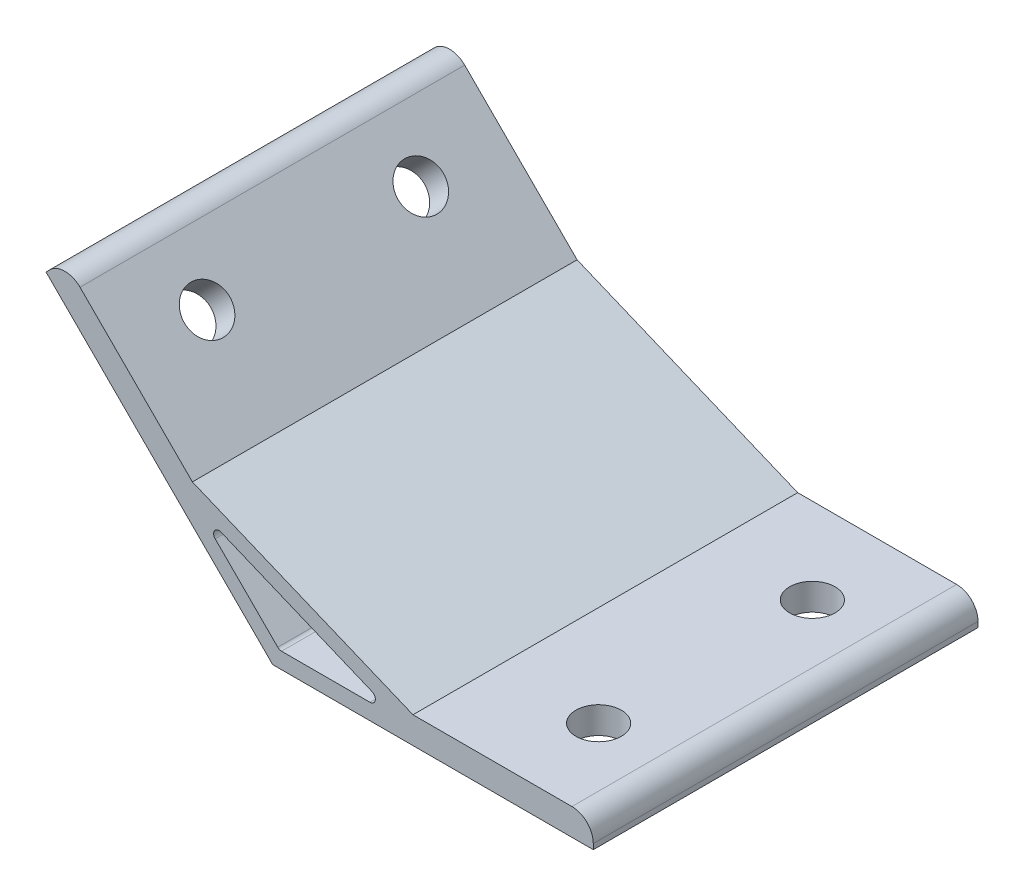
ISO-10303-21;
HEADER;
FILE_DESCRIPTION(('STEP AP214'),'2;1');
FILE_NAME('part.step','',(''),(''),'','','');
FILE_SCHEMA(('AUTOMOTIVE_DESIGN { 1 0 10303 214 1 1 1 1 }'));
ENDSEC;
DATA;
#1=APPLICATION_CONTEXT('core data for automotive mechanical design processes');
#2=APPLICATION_PROTOCOL_DEFINITION('international standard','automotive_design',2000,#1);
#3=PRODUCT_CONTEXT('',#1,'mechanical');
#4=PRODUCT('Part','Part','',(#3));
#5=PRODUCT_RELATED_PRODUCT_CATEGORY('part','',(#4));
#6=PRODUCT_DEFINITION_FORMATION('','',#4);
#7=PRODUCT_DEFINITION_CONTEXT('part definition',#1,'design');
#8=PRODUCT_DEFINITION('design','',#6,#7);
#9=PRODUCT_DEFINITION_SHAPE('','',#8);
#10=(LENGTH_UNIT() NAMED_UNIT(*) SI_UNIT(.MILLI.,.METRE.));
#11=(NAMED_UNIT(*) PLANE_ANGLE_UNIT() SI_UNIT($,.RADIAN.));
#12=(NAMED_UNIT(*) SI_UNIT($,.STERADIAN.) SOLID_ANGLE_UNIT());
#13=UNCERTAINTY_MEASURE_WITH_UNIT(LENGTH_MEASURE(1.E-05),#10,'distance_accuracy_value','');
#14=(GEOMETRIC_REPRESENTATION_CONTEXT(3) GLOBAL_UNCERTAINTY_ASSIGNED_CONTEXT((#13)) GLOBAL_UNIT_ASSIGNED_CONTEXT((#10,
#11,#12)) REPRESENTATION_CONTEXT('',''));
#15=CARTESIAN_POINT('',(0.,0.,0.));
#16=DIRECTION('',(0.,0.,1.));
#17=DIRECTION('',(1.,0.,0.));
#18=AXIS2_PLACEMENT_3D('',#15,#16,#17);
#19=CARTESIAN_POINT('',(0.,0.,36.));
#20=DIRECTION('',(0.,0.,1.));
#21=DIRECTION('',(1.,0.,0.));
#22=AXIS2_PLACEMENT_3D('',#19,#20,#21);
#23=PLANE('',#22);
#24=DIRECTION('',(0.,1.,0.));
#25=VECTOR('',#24,1.);
#26=CARTESIAN_POINT('',(60.,5.,36.));
#27=LINE('',#26,#25);
#28=CARTESIAN_POINT('',(60.,0.,36.));
#29=VERTEX_POINT('',#28);
#30=CARTESIAN_POINT('',(60.,1.,36.));
#31=VERTEX_POINT('',#30);
#32=EDGE_CURVE('E141',#29,#31,#27,.T.);
#33=ORIENTED_EDGE('',*,*,#32,.T.);
#34=CARTESIAN_POINT('',(56.,1.,36.));
#35=DIRECTION('',(0.,0.,1.));
#36=DIRECTION('',(1.,0.,0.));
#37=AXIS2_PLACEMENT_3D('',#34,#35,#36);
#38=CIRCLE('',#37,4.);
#39=CARTESIAN_POINT('',(56.,5.,36.));
#40=VERTEX_POINT('',#39);
#41=EDGE_CURVE('E183',#31,#40,#38,.T.);
#42=ORIENTED_EDGE('',*,*,#41,.T.);
#43=DIRECTION('',(-1.,0.,0.));
#44=VECTOR('',#43,1.);
#45=CARTESIAN_POINT('',(26.2535913516314,5.,36.));
#46=LINE('',#45,#44);
#47=CARTESIAN_POINT('',(26.2535913516314,5.,36.));
#48=VERTEX_POINT('',#47);
#49=EDGE_CURVE('E152',#40,#48,#46,.T.);
#50=ORIENTED_EDGE('',*,*,#49,.T.);
#51=DIRECTION('',(-0.923879532511286,0.382683432365091,0.));
#52=VECTOR('',#51,1.);
#53=CARTESIAN_POINT('',(-15.0285585693063,22.0996263811718,36.));
#54=LINE('',#53,#52);
#55=CARTESIAN_POINT('',(-15.0285585693063,22.0996263811718,36.));
#56=VERTEX_POINT('',#55);
#57=EDGE_CURVE('E243',#48,#56,#54,.T.);
#58=ORIENTED_EDGE('',*,*,#57,.T.);
#59=DIRECTION('',(-0.707106781186549,0.707106781186547,0.));
#60=VECTOR('',#59,1.);
#61=CARTESIAN_POINT('',(-38.8908729652601,45.9619407771256,36.));
#62=LINE('',#61,#60);
#63=CARTESIAN_POINT('',(-36.0624458405139,43.1335136523794,36.));
#64=VERTEX_POINT('',#63);
#65=EDGE_CURVE('E245',#56,#64,#62,.T.);
#66=ORIENTED_EDGE('',*,*,#65,.T.);
#67=CARTESIAN_POINT('',(-38.8908729652601,40.3050865276332,36.));
#68=DIRECTION('',(0.,0.,1.));
#69=DIRECTION('',(1.,0.,0.));
#70=AXIS2_PLACEMENT_3D('',#67,#68,#69);
#71=CIRCLE('',#70,4.);
#72=CARTESIAN_POINT('',(-41.7193000900063,43.1335136523794,36.));
#73=VERTEX_POINT('',#72);
#74=EDGE_CURVE('E181',#64,#73,#71,.T.);
#75=ORIENTED_EDGE('',*,*,#74,.T.);
#76=DIRECTION('',(-0.707106781186547,-0.707106781186548,0.));
#77=VECTOR('',#76,1.);
#78=CARTESIAN_POINT('',(-42.4264068711928,42.4264068711929,36.));
#79=LINE('',#78,#77);
#80=CARTESIAN_POINT('',(-42.4264068711928,42.4264068711929,36.));
#81=VERTEX_POINT('',#80);
#82=EDGE_CURVE('E248',#73,#81,#79,.T.);
#83=ORIENTED_EDGE('',*,*,#82,.T.);
#84=DIRECTION('',(0.707106781186546,-0.707106781186549,0.));
#85=VECTOR('',#84,1.);
#86=CARTESIAN_POINT('',(0.,0.,36.));
#87=LINE('',#86,#85);
#88=CARTESIAN_POINT('',(0.,0.,36.));
#89=VERTEX_POINT('',#88);
#90=EDGE_CURVE('E157',#81,#89,#87,.T.);
#91=ORIENTED_EDGE('',*,*,#90,.T.);
#92=DIRECTION('',(1.,0.,0.));
#93=VECTOR('',#92,1.);
#94=CARTESIAN_POINT('',(60.,0.,36.));
#95=LINE('',#94,#93);
#96=EDGE_CURVE('E153',#89,#29,#95,.T.);
#97=ORIENTED_EDGE('',*,*,#96,.T.);
#98=EDGE_LOOP('',(#33,#42,#50,#58,#66,#75,#83,#91,#97));
#99=FACE_BOUND('',#98,.T.);
#100=DIRECTION('',(1.,0.,0.));
#101=VECTOR('',#100,1.);
#102=CARTESIAN_POINT('',(23.2426406871193,3.,36.));
#103=LINE('',#102,#101);
#104=CARTESIAN_POINT('',(1.65685424949239,3.,36.));
#105=VERTEX_POINT('',#104);
#106=CARTESIAN_POINT('',(18.2153011949935,3.,36.));
#107=VERTEX_POINT('',#106);
#108=EDGE_CURVE('E228',#105,#107,#103,.T.);
#109=ORIENTED_EDGE('',*,*,#108,.F.);
#110=CARTESIAN_POINT('',(1.65685424949239,4.,36.));
#111=DIRECTION('',(0.,0.,1.));
#112=DIRECTION('',(1.,0.,0.));
#113=AXIS2_PLACEMENT_3D('',#110,#111,#112);
#114=CIRCLE('',#113,1.);
#115=CARTESIAN_POINT('',(0.949747468305838,3.29289321881345,36.));
#116=VERTEX_POINT('',#115);
#117=EDGE_CURVE('E210',#105,#116,#114,.F.);
#118=ORIENTED_EDGE('',*,*,#117,.T.);
#119=DIRECTION('',(0.707106781186546,-0.707106781186549,0.));
#120=VECTOR('',#119,1.);
#121=CARTESIAN_POINT('',(1.24264068711929,3.,36.));
#122=LINE('',#121,#120);
#123=CARTESIAN_POINT('',(-10.7588426527756,15.001483339895,36.));
#124=VERTEX_POINT('',#123);
#125=EDGE_CURVE('E225',#124,#116,#122,.T.);
#126=ORIENTED_EDGE('',*,*,#125,.F.);
#127=CARTESIAN_POINT('',(-10.0517358715891,15.7085901210815,36.));
#128=DIRECTION('',(0.,0.,1.));
#129=DIRECTION('',(1.,0.,0.));
#130=AXIS2_PLACEMENT_3D('',#127,#128,#129);
#131=CIRCLE('',#130,1.);
#132=CARTESIAN_POINT('',(-9.66905243922398,16.6324696535928,36.));
#133=VERTEX_POINT('',#132);
#134=EDGE_CURVE('E206',#124,#133,#131,.F.);
#135=ORIENTED_EDGE('',*,*,#134,.T.);
#136=DIRECTION('',(-0.923879532511286,0.382683432365091,0.));
#137=VECTOR('',#136,1.);
#138=CARTESIAN_POINT('',(-14.3137084989847,18.5563491861041,36.));
#139=LINE('',#138,#137);
#140=CARTESIAN_POINT('',(18.5979846273586,4.92387953251128,36.));
#141=VERTEX_POINT('',#140);
#142=EDGE_CURVE('E230',#141,#133,#139,.T.);
#143=ORIENTED_EDGE('',*,*,#142,.F.);
#144=CARTESIAN_POINT('',(18.2153011949935,4.,36.));
#145=DIRECTION('',(0.,0.,1.));
#146=DIRECTION('',(1.,0.,0.));
#147=AXIS2_PLACEMENT_3D('',#144,#145,#146);
#148=CIRCLE('',#147,1.);
#149=EDGE_CURVE('E11',#141,#107,#148,.F.);
#150=ORIENTED_EDGE('',*,*,#149,.T.);
#151=EDGE_LOOP('',(#109,#118,#126,#135,#143,#150));
#152=FACE_BOUND('',#151,.T.);
#153=ADVANCED_FACE('F34',(#99,#152),#23,.T.);
#154=CARTESIAN_POINT('',(0.,0.,-36.));
#155=DIRECTION('',(0.,0.,1.));
#156=DIRECTION('',(1.,0.,0.));
#157=AXIS2_PLACEMENT_3D('',#154,#155,#156);
#158=PLANE('',#157);
#159=DIRECTION('',(-1.,0.,0.));
#160=VECTOR('',#159,1.);
#161=CARTESIAN_POINT('',(26.2535913516314,5.,-36.));
#162=LINE('',#161,#160);
#163=CARTESIAN_POINT('',(56.,5.,-36.));
#164=VERTEX_POINT('',#163);
#165=CARTESIAN_POINT('',(26.2535913516314,5.,-36.));
#166=VERTEX_POINT('',#165);
#167=EDGE_CURVE('E255',#164,#166,#162,.T.);
#168=ORIENTED_EDGE('',*,*,#167,.F.);
#169=CARTESIAN_POINT('',(56.,1.,-36.));
#170=DIRECTION('',(0.,0.,1.));
#171=DIRECTION('',(1.,0.,0.));
#172=AXIS2_PLACEMENT_3D('',#169,#170,#171);
#173=CIRCLE('',#172,4.);
#174=CARTESIAN_POINT('',(60.,1.,-36.));
#175=VERTEX_POINT('',#174);
#176=EDGE_CURVE('E178',#164,#175,#173,.F.);
#177=ORIENTED_EDGE('',*,*,#176,.T.);
#178=DIRECTION('',(0.,1.,0.));
#179=VECTOR('',#178,1.);
#180=CARTESIAN_POINT('',(60.,5.,-36.));
#181=LINE('',#180,#179);
#182=CARTESIAN_POINT('',(60.,0.,-36.));
#183=VERTEX_POINT('',#182);
#184=EDGE_CURVE('E253',#183,#175,#181,.T.);
#185=ORIENTED_EDGE('',*,*,#184,.F.);
#186=DIRECTION('',(1.,0.,0.));
#187=VECTOR('',#186,1.);
#188=CARTESIAN_POINT('',(60.,0.,-36.));
#189=LINE('',#188,#187);
#190=CARTESIAN_POINT('',(0.,0.,-36.));
#191=VERTEX_POINT('',#190);
#192=EDGE_CURVE('E165',#191,#183,#189,.T.);
#193=ORIENTED_EDGE('',*,*,#192,.F.);
#194=DIRECTION('',(0.707106781186546,-0.707106781186549,0.));
#195=VECTOR('',#194,1.);
#196=CARTESIAN_POINT('',(0.,0.,-36.));
#197=LINE('',#196,#195);
#198=CARTESIAN_POINT('',(-42.4264068711928,42.4264068711929,-36.));
#199=VERTEX_POINT('',#198);
#200=EDGE_CURVE('E161',#199,#191,#197,.T.);
#201=ORIENTED_EDGE('',*,*,#200,.F.);
#202=DIRECTION('',(-0.707106781186547,-0.707106781186548,0.));
#203=VECTOR('',#202,1.);
#204=CARTESIAN_POINT('',(-42.4264068711928,42.4264068711929,-36.));
#205=LINE('',#204,#203);
#206=CARTESIAN_POINT('',(-41.7193000900063,43.1335136523794,-36.));
#207=VERTEX_POINT('',#206);
#208=EDGE_CURVE('E262',#207,#199,#205,.T.);
#209=ORIENTED_EDGE('',*,*,#208,.F.);
#210=CARTESIAN_POINT('',(-38.8908729652601,40.3050865276332,-36.));
#211=DIRECTION('',(0.,0.,1.));
#212=DIRECTION('',(1.,0.,0.));
#213=AXIS2_PLACEMENT_3D('',#210,#211,#212);
#214=CIRCLE('',#213,4.);
#215=CARTESIAN_POINT('',(-36.0624458405139,43.1335136523794,-36.));
#216=VERTEX_POINT('',#215);
#217=EDGE_CURVE('E170',#207,#216,#214,.F.);
#218=ORIENTED_EDGE('',*,*,#217,.T.);
#219=DIRECTION('',(-0.707106781186549,0.707106781186547,0.));
#220=VECTOR('',#219,1.);
#221=CARTESIAN_POINT('',(-38.8908729652601,45.9619407771256,-36.));
#222=LINE('',#221,#220);
#223=CARTESIAN_POINT('',(-15.0285585693063,22.0996263811718,-36.));
#224=VERTEX_POINT('',#223);
#225=EDGE_CURVE('E259',#224,#216,#222,.T.);
#226=ORIENTED_EDGE('',*,*,#225,.F.);
#227=DIRECTION('',(-0.923879532511286,0.382683432365091,0.));
#228=VECTOR('',#227,1.);
#229=CARTESIAN_POINT('',(-15.0285585693063,22.0996263811718,-36.));
#230=LINE('',#229,#228);
#231=EDGE_CURVE('E257',#166,#224,#230,.T.);
#232=ORIENTED_EDGE('',*,*,#231,.F.);
#233=EDGE_LOOP('',(#168,#177,#185,#193,#201,#209,#218,#226,#232));
#234=FACE_BOUND('',#233,.T.);
#235=DIRECTION('',(-0.923879532511286,0.382683432365091,0.));
#236=VECTOR('',#235,1.);
#237=CARTESIAN_POINT('',(-14.3137084989847,18.5563491861041,-36.));
#238=LINE('',#237,#236);
#239=CARTESIAN_POINT('',(18.5979846273586,4.92387953251128,-36.));
#240=VERTEX_POINT('',#239);
#241=CARTESIAN_POINT('',(-9.66905243922398,16.6324696535928,-36.));
#242=VERTEX_POINT('',#241);
#243=EDGE_CURVE('E216',#240,#242,#238,.T.);
#244=ORIENTED_EDGE('',*,*,#243,.T.);
#245=CARTESIAN_POINT('',(-10.0517358715891,15.7085901210815,-36.));
#246=DIRECTION('',(0.,0.,1.));
#247=DIRECTION('',(1.,0.,0.));
#248=AXIS2_PLACEMENT_3D('',#245,#246,#247);
#249=CIRCLE('',#248,1.);
#250=CARTESIAN_POINT('',(-10.7588426527756,15.001483339895,-36.));
#251=VERTEX_POINT('',#250);
#252=EDGE_CURVE('E204',#242,#251,#249,.T.);
#253=ORIENTED_EDGE('',*,*,#252,.T.);
#254=DIRECTION('',(0.707106781186546,-0.707106781186549,0.));
#255=VECTOR('',#254,1.);
#256=CARTESIAN_POINT('',(1.24264068711929,3.,-36.));
#257=LINE('',#256,#255);
#258=CARTESIAN_POINT('',(0.949747468305838,3.29289321881345,-36.));
#259=VERTEX_POINT('',#258);
#260=EDGE_CURVE('E237',#251,#259,#257,.T.);
#261=ORIENTED_EDGE('',*,*,#260,.T.);
#262=CARTESIAN_POINT('',(1.65685424949239,4.,-36.));
#263=DIRECTION('',(0.,0.,1.));
#264=DIRECTION('',(1.,0.,0.));
#265=AXIS2_PLACEMENT_3D('',#262,#263,#264);
#266=CIRCLE('',#265,1.);
#267=CARTESIAN_POINT('',(1.65685424949239,3.,-36.));
#268=VERTEX_POINT('',#267);
#269=EDGE_CURVE('E208',#259,#268,#266,.T.);
#270=ORIENTED_EDGE('',*,*,#269,.T.);
#271=DIRECTION('',(1.,0.,0.));
#272=VECTOR('',#271,1.);
#273=CARTESIAN_POINT('',(23.2426406871193,3.,-36.));
#274=LINE('',#273,#272);
#275=CARTESIAN_POINT('',(18.2153011949935,3.,-36.));
#276=VERTEX_POINT('',#275);
#277=EDGE_CURVE('E217',#268,#276,#274,.T.);
#278=ORIENTED_EDGE('',*,*,#277,.T.);
#279=CARTESIAN_POINT('',(18.2153011949935,4.,-36.));
#280=DIRECTION('',(0.,0.,1.));
#281=DIRECTION('',(1.,0.,0.));
#282=AXIS2_PLACEMENT_3D('',#279,#280,#281);
#283=CIRCLE('',#282,1.);
#284=EDGE_CURVE('E42',#276,#240,#283,.T.);
#285=ORIENTED_EDGE('',*,*,#284,.T.);
#286=EDGE_LOOP('',(#244,#253,#261,#270,#278,#285));
#287=FACE_BOUND('',#286,.T.);
#288=ADVANCED_FACE('F215',(#234,#287),#158,.F.);
#289=CARTESIAN_POINT('',(60.,0.,36.));
#290=DIRECTION('',(0.,1.,0.));
#291=DIRECTION('',(0.,0.,1.));
#292=AXIS2_PLACEMENT_3D('',#289,#290,#291);
#293=PLANE('',#292);
#294=CARTESIAN_POINT('',(45.,0.,20.));
#295=DIRECTION('',(0.,-1.,0.));
#296=DIRECTION('',(0.,0.,-1.));
#297=AXIS2_PLACEMENT_3D('',#294,#295,#296);
#298=CIRCLE('',#297,4.25);
#299=CARTESIAN_POINT('',(45.,0.,15.75));
#300=VERTEX_POINT('',#299);
#301=EDGE_CURVE('E343',#300,#300,#298,.T.);
#302=ORIENTED_EDGE('',*,*,#301,.F.);
#303=EDGE_LOOP('',(#302));
#304=FACE_BOUND('',#303,.T.);
#305=CARTESIAN_POINT('',(45.,0.,-20.));
#306=DIRECTION('',(0.,-1.,0.));
#307=DIRECTION('',(0.,0.,-1.));
#308=AXIS2_PLACEMENT_3D('',#305,#306,#307);
#309=CIRCLE('',#308,4.25);
#310=CARTESIAN_POINT('',(45.,0.,-24.25));
#311=VERTEX_POINT('',#310);
#312=EDGE_CURVE('E346',#311,#311,#309,.T.);
#313=ORIENTED_EDGE('',*,*,#312,.F.);
#314=EDGE_LOOP('',(#313));
#315=FACE_BOUND('',#314,.T.);
#316=ORIENTED_EDGE('',*,*,#192,.T.);
#317=DIRECTION('',(0.,0.,-1.));
#318=VECTOR('',#317,1.);
#319=CARTESIAN_POINT('',(60.,0.,36.));
#320=LINE('',#319,#318);
#321=EDGE_CURVE('E146',#29,#183,#320,.T.);
#322=ORIENTED_EDGE('',*,*,#321,.F.);
#323=ORIENTED_EDGE('',*,*,#96,.F.);
#324=DIRECTION('',(0.,0.,-1.));
#325=VECTOR('',#324,1.);
#326=CARTESIAN_POINT('',(0.,0.,36.));
#327=LINE('',#326,#325);
#328=EDGE_CURVE('E251',#89,#191,#327,.T.);
#329=ORIENTED_EDGE('',*,*,#328,.T.);
#330=EDGE_LOOP('',(#316,#322,#323,#329));
#331=FACE_BOUND('',#330,.T.);
#332=ADVANCED_FACE('F163',(#304,#315,#331),#293,.F.);
#333=CARTESIAN_POINT('',(60.,5.,36.));
#334=DIRECTION('',(-1.,0.,0.));
#335=DIRECTION('',(0.,0.,1.));
#336=AXIS2_PLACEMENT_3D('',#333,#334,#335);
#337=PLANE('',#336);
#338=ORIENTED_EDGE('',*,*,#184,.T.);
#339=DIRECTION('',(0.,0.,-1.));
#340=VECTOR('',#339,1.);
#341=CARTESIAN_POINT('',(60.,1.,36.));
#342=LINE('',#341,#340);
#343=EDGE_CURVE('E149',#175,#31,#342,.F.);
#344=ORIENTED_EDGE('',*,*,#343,.T.);
#345=ORIENTED_EDGE('',*,*,#32,.F.);
#346=ORIENTED_EDGE('',*,*,#321,.T.);
#347=EDGE_LOOP('',(#338,#344,#345,#346));
#348=FACE_BOUND('',#347,.T.);
#349=ADVANCED_FACE('F144',(#348),#337,.F.);
#350=CARTESIAN_POINT('',(26.2535913516314,5.,36.));
#351=DIRECTION('',(0.,-1.,0.));
#352=DIRECTION('',(0.,0.,-1.));
#353=AXIS2_PLACEMENT_3D('',#350,#351,#352);
#354=PLANE('',#353);
#355=CARTESIAN_POINT('',(45.,5.,20.));
#356=DIRECTION('',(0.,-1.,0.));
#357=DIRECTION('',(0.,0.,-1.));
#358=AXIS2_PLACEMENT_3D('',#355,#356,#357);
#359=CIRCLE('',#358,4.25);
#360=CARTESIAN_POINT('',(45.,5.,15.75));
#361=VERTEX_POINT('',#360);
#362=EDGE_CURVE('E353',#361,#361,#359,.F.);
#363=ORIENTED_EDGE('',*,*,#362,.F.);
#364=EDGE_LOOP('',(#363));
#365=FACE_BOUND('',#364,.T.);
#366=CARTESIAN_POINT('',(45.,5.,-20.));
#367=DIRECTION('',(0.,-1.,0.));
#368=DIRECTION('',(0.,0.,-1.));
#369=AXIS2_PLACEMENT_3D('',#366,#367,#368);
#370=CIRCLE('',#369,4.25);
#371=CARTESIAN_POINT('',(45.,5.,-24.25));
#372=VERTEX_POINT('',#371);
#373=EDGE_CURVE('E348',#372,#372,#370,.F.);
#374=ORIENTED_EDGE('',*,*,#373,.F.);
#375=EDGE_LOOP('',(#374));
#376=FACE_BOUND('',#375,.T.);
#377=ORIENTED_EDGE('',*,*,#49,.F.);
#378=DIRECTION('',(0.,0.,-1.));
#379=VECTOR('',#378,1.);
#380=CARTESIAN_POINT('',(56.,5.,36.));
#381=LINE('',#380,#379);
#382=EDGE_CURVE('E166',#40,#164,#381,.T.);
#383=ORIENTED_EDGE('',*,*,#382,.T.);
#384=ORIENTED_EDGE('',*,*,#167,.T.);
#385=DIRECTION('',(0.,0.,-1.));
#386=VECTOR('',#385,1.);
#387=CARTESIAN_POINT('',(26.2535913516314,5.,36.));
#388=LINE('',#387,#386);
#389=EDGE_CURVE('E167',#48,#166,#388,.T.);
#390=ORIENTED_EDGE('',*,*,#389,.F.);
#391=EDGE_LOOP('',(#377,#383,#384,#390));
#392=FACE_BOUND('',#391,.T.);
#393=ADVANCED_FACE('F294',(#365,#376,#392),#354,.F.);
#394=CARTESIAN_POINT('',(-15.0285585693063,22.0996263811718,36.));
#395=DIRECTION('',(-0.382683432365091,-0.923879532511286,0.));
#396=DIRECTION('',(0.923879532511287,-0.382683432365091,0.));
#397=AXIS2_PLACEMENT_3D('',#394,#395,#396);
#398=PLANE('',#397);
#399=ORIENTED_EDGE('',*,*,#231,.T.);
#400=DIRECTION('',(0.,0.,-1.));
#401=VECTOR('',#400,1.);
#402=CARTESIAN_POINT('',(-15.0285585693063,22.0996263811718,36.));
#403=LINE('',#402,#401);
#404=EDGE_CURVE('E173',#56,#224,#403,.T.);
#405=ORIENTED_EDGE('',*,*,#404,.F.);
#406=ORIENTED_EDGE('',*,*,#57,.F.);
#407=ORIENTED_EDGE('',*,*,#389,.T.);
#408=EDGE_LOOP('',(#399,#405,#406,#407));
#409=FACE_BOUND('',#408,.T.);
#410=ADVANCED_FACE('F292',(#409),#398,.F.);
#411=CARTESIAN_POINT('',(-38.8908729652601,45.9619407771256,36.));
#412=DIRECTION('',(-0.707106781186547,-0.707106781186548,0.));
#413=DIRECTION('',(0.707106781186548,-0.707106781186547,0.));
#414=AXIS2_PLACEMENT_3D('',#411,#412,#413);
#415=PLANE('',#414);
#416=CARTESIAN_POINT('',(-28.2842712474619,35.3553390593274,-20.));
#417=DIRECTION('',(-0.707106781186547,-0.707106781186548,0.));
#418=DIRECTION('',(0.707106781186548,-0.707106781186547,0.));
#419=AXIS2_PLACEMENT_3D('',#416,#417,#418);
#420=CIRCLE('',#419,4.25);
#421=CARTESIAN_POINT('',(-25.279067427419,32.3501352392846,-20.));
#422=VERTEX_POINT('',#421);
#423=EDGE_CURVE('E240',#422,#422,#420,.F.);
#424=ORIENTED_EDGE('',*,*,#423,.F.);
#425=EDGE_LOOP('',(#424));
#426=FACE_BOUND('',#425,.T.);
#427=CARTESIAN_POINT('',(-28.2842712474619,35.3553390593274,20.));
#428=DIRECTION('',(-0.707106781186547,-0.707106781186548,0.));
#429=DIRECTION('',(0.707106781186548,-0.707106781186547,0.));
#430=AXIS2_PLACEMENT_3D('',#427,#428,#429);
#431=CIRCLE('',#430,4.25000000000001);
#432=CARTESIAN_POINT('',(-25.279067427419,32.3501352392845,20.));
#433=VERTEX_POINT('',#432);
#434=EDGE_CURVE('E359',#433,#433,#431,.F.);
#435=ORIENTED_EDGE('',*,*,#434,.F.);
#436=EDGE_LOOP('',(#435));
#437=FACE_BOUND('',#436,.T.);
#438=ORIENTED_EDGE('',*,*,#225,.T.);
#439=DIRECTION('',(0.,0.,-1.));
#440=VECTOR('',#439,1.);
#441=CARTESIAN_POINT('',(-36.0624458405139,43.1335136523794,36.));
#442=LINE('',#441,#440);
#443=EDGE_CURVE('E188',#216,#64,#442,.F.);
#444=ORIENTED_EDGE('',*,*,#443,.T.);
#445=ORIENTED_EDGE('',*,*,#65,.F.);
#446=ORIENTED_EDGE('',*,*,#404,.T.);
#447=EDGE_LOOP('',(#438,#444,#445,#446));
#448=FACE_BOUND('',#447,.T.);
#449=ADVANCED_FACE('F273',(#426,#437,#448),#415,.F.);
#450=CARTESIAN_POINT('',(-42.4264068711928,42.4264068711929,36.));
#451=DIRECTION('',(0.707106781186548,-0.707106781186547,0.));
#452=DIRECTION('',(0.707106781186547,0.707106781186548,0.));
#453=AXIS2_PLACEMENT_3D('',#450,#451,#452);
#454=PLANE('',#453);
#455=ORIENTED_EDGE('',*,*,#82,.F.);
#456=DIRECTION('',(0.,0.,-1.));
#457=VECTOR('',#456,1.);
#458=CARTESIAN_POINT('',(-41.7193000900063,43.1335136523794,36.));
#459=LINE('',#458,#457);
#460=EDGE_CURVE('E185',#73,#207,#459,.T.);
#461=ORIENTED_EDGE('',*,*,#460,.T.);
#462=ORIENTED_EDGE('',*,*,#208,.T.);
#463=DIRECTION('',(0.,0.,-1.));
#464=VECTOR('',#463,1.);
#465=CARTESIAN_POINT('',(-42.4264068711928,42.4264068711929,36.));
#466=LINE('',#465,#464);
#467=EDGE_CURVE('E266',#81,#199,#466,.T.);
#468=ORIENTED_EDGE('',*,*,#467,.F.);
#469=EDGE_LOOP('',(#455,#461,#462,#468));
#470=FACE_BOUND('',#469,.T.);
#471=ADVANCED_FACE('F288',(#470),#454,.F.);
#472=CARTESIAN_POINT('',(0.,0.,36.));
#473=DIRECTION('',(0.707106781186549,0.707106781186546,0.));
#474=DIRECTION('',(-0.707106781186546,0.707106781186549,0.));
#475=AXIS2_PLACEMENT_3D('',#472,#473,#474);
#476=PLANE('',#475);
#477=CARTESIAN_POINT('',(-31.8198051533946,31.8198051533947,-20.));
#478=DIRECTION('',(-0.707106781186549,-0.707106781186546,0.));
#479=DIRECTION('',(0.707106781186546,-0.707106781186549,0.));
#480=AXIS2_PLACEMENT_3D('',#477,#478,#479);
#481=CIRCLE('',#480,4.25);
#482=CARTESIAN_POINT('',(-28.8146013333518,28.8146013333518,-20.));
#483=VERTEX_POINT('',#482);
#484=EDGE_CURVE('E356',#483,#483,#481,.T.);
#485=ORIENTED_EDGE('',*,*,#484,.F.);
#486=EDGE_LOOP('',(#485));
#487=FACE_BOUND('',#486,.T.);
#488=CARTESIAN_POINT('',(-31.8198051533946,31.8198051533947,20.));
#489=DIRECTION('',(-0.707106781186549,-0.707106781186546,0.));
#490=DIRECTION('',(0.707106781186546,-0.707106781186549,0.));
#491=AXIS2_PLACEMENT_3D('',#488,#489,#490);
#492=CIRCLE('',#491,4.25000000000001);
#493=CARTESIAN_POINT('',(-28.8146013333517,28.8146013333518,20.));
#494=VERTEX_POINT('',#493);
#495=EDGE_CURVE('E362',#494,#494,#492,.T.);
#496=ORIENTED_EDGE('',*,*,#495,.F.);
#497=EDGE_LOOP('',(#496));
#498=FACE_BOUND('',#497,.T.);
#499=ORIENTED_EDGE('',*,*,#200,.T.);
#500=ORIENTED_EDGE('',*,*,#328,.F.);
#501=ORIENTED_EDGE('',*,*,#90,.F.);
#502=ORIENTED_EDGE('',*,*,#467,.T.);
#503=EDGE_LOOP('',(#499,#500,#501,#502));
#504=FACE_BOUND('',#503,.T.);
#505=ADVANCED_FACE('F321',(#487,#498,#504),#476,.F.);
#506=CARTESIAN_POINT('',(1.24264068711929,3.,36.));
#507=DIRECTION('',(0.707106781186549,0.707106781186546,0.));
#508=DIRECTION('',(-0.707106781186546,0.707106781186549,0.));
#509=AXIS2_PLACEMENT_3D('',#506,#507,#508);
#510=PLANE('',#509);
#511=ORIENTED_EDGE('',*,*,#260,.F.);
#512=DIRECTION('',(0.,0.,-1.));
#513=VECTOR('',#512,1.);
#514=CARTESIAN_POINT('',(-10.7588426527756,15.001483339895,36.));
#515=LINE('',#514,#513);
#516=EDGE_CURVE('E198',#251,#124,#515,.F.);
#517=ORIENTED_EDGE('',*,*,#516,.T.);
#518=ORIENTED_EDGE('',*,*,#125,.T.);
#519=DIRECTION('',(0.,0.,-1.));
#520=VECTOR('',#519,1.);
#521=CARTESIAN_POINT('',(0.949747468305838,3.29289321881345,-36.));
#522=LINE('',#521,#520);
#523=EDGE_CURVE('E195',#116,#259,#522,.T.);
#524=ORIENTED_EDGE('',*,*,#523,.T.);
#525=EDGE_LOOP('',(#511,#517,#518,#524));
#526=FACE_BOUND('',#525,.T.);
#527=ADVANCED_FACE('F318',(#526),#510,.T.);
#528=CARTESIAN_POINT('',(23.2426406871193,3.,36.));
#529=DIRECTION('',(0.,1.,0.));
#530=DIRECTION('',(0.,0.,1.));
#531=AXIS2_PLACEMENT_3D('',#528,#529,#530);
#532=PLANE('',#531);
#533=ORIENTED_EDGE('',*,*,#277,.F.);
#534=DIRECTION('',(0.,0.,-1.));
#535=VECTOR('',#534,1.);
#536=CARTESIAN_POINT('',(1.65685424949239,3.,36.));
#537=LINE('',#536,#535);
#538=EDGE_CURVE('E54',#268,#105,#537,.F.);
#539=ORIENTED_EDGE('',*,*,#538,.T.);
#540=ORIENTED_EDGE('',*,*,#108,.T.);
#541=DIRECTION('',(0.,0.,-1.));
#542=VECTOR('',#541,1.);
#543=CARTESIAN_POINT('',(18.2153011949935,3.,-36.));
#544=LINE('',#543,#542);
#545=EDGE_CURVE('E200',#107,#276,#544,.T.);
#546=ORIENTED_EDGE('',*,*,#545,.T.);
#547=EDGE_LOOP('',(#533,#539,#540,#546));
#548=FACE_BOUND('',#547,.T.);
#549=ADVANCED_FACE('F227',(#548),#532,.T.);
#550=CARTESIAN_POINT('',(-14.3137084989847,18.5563491861041,36.));
#551=DIRECTION('',(-0.382683432365091,-0.923879532511286,0.));
#552=DIRECTION('',(0.923879532511287,-0.382683432365091,0.));
#553=AXIS2_PLACEMENT_3D('',#550,#551,#552);
#554=PLANE('',#553);
#555=ORIENTED_EDGE('',*,*,#142,.T.);
#556=DIRECTION('',(0.,0.,-1.));
#557=VECTOR('',#556,1.);
#558=CARTESIAN_POINT('',(-9.66905243922398,16.6324696535928,-36.));
#559=LINE('',#558,#557);
#560=EDGE_CURVE('E192',#133,#242,#559,.T.);
#561=ORIENTED_EDGE('',*,*,#560,.T.);
#562=ORIENTED_EDGE('',*,*,#243,.F.);
#563=DIRECTION('',(0.,0.,-1.));
#564=VECTOR('',#563,1.);
#565=CARTESIAN_POINT('',(18.5979846273585,4.92387953251129,36.));
#566=LINE('',#565,#564);
#567=EDGE_CURVE('E190',#240,#141,#566,.F.);
#568=ORIENTED_EDGE('',*,*,#567,.T.);
#569=EDGE_LOOP('',(#555,#561,#562,#568));
#570=FACE_BOUND('',#569,.T.);
#571=ADVANCED_FACE('F223',(#570),#554,.T.);
#572=CARTESIAN_POINT('',(-19.7842712474618,43.8553390593274,20.));
#573=DIRECTION('',(-0.707106781186549,-0.707106781186547,0.));
#574=DIRECTION('',(0.707106781186547,-0.707106781186549,0.));
#575=AXIS2_PLACEMENT_3D('',#572,#573,#574);
#576=CYLINDRICAL_SURFACE('',#575,4.25000000000001);
#577=ORIENTED_EDGE('',*,*,#434,.T.);
#578=EDGE_LOOP('',(#577));
#579=FACE_BOUND('',#578,.T.);
#580=ORIENTED_EDGE('',*,*,#495,.T.);
#581=EDGE_LOOP('',(#580));
#582=FACE_BOUND('',#581,.T.);
#583=ADVANCED_FACE('F367',(#579,#582),#576,.F.);
#584=CARTESIAN_POINT('',(-19.7842712474618,43.8553390593274,-20.));
#585=DIRECTION('',(-0.707106781186549,-0.707106781186547,0.));
#586=DIRECTION('',(0.707106781186547,-0.707106781186549,0.));
#587=AXIS2_PLACEMENT_3D('',#584,#585,#586);
#588=CYLINDRICAL_SURFACE('',#587,4.25);
#589=ORIENTED_EDGE('',*,*,#423,.T.);
#590=EDGE_LOOP('',(#589));
#591=FACE_BOUND('',#590,.T.);
#592=ORIENTED_EDGE('',*,*,#484,.T.);
#593=EDGE_LOOP('',(#592));
#594=FACE_BOUND('',#593,.T.);
#595=ADVANCED_FACE('F371',(#591,#594),#588,.F.);
#596=CARTESIAN_POINT('',(45.,17.0208152801713,-20.));
#597=DIRECTION('',(0.,-1.,0.));
#598=DIRECTION('',(0.,0.,-1.));
#599=AXIS2_PLACEMENT_3D('',#596,#597,#598);
#600=CYLINDRICAL_SURFACE('',#599,4.25);
#601=ORIENTED_EDGE('',*,*,#373,.T.);
#602=EDGE_LOOP('',(#601));
#603=FACE_BOUND('',#602,.T.);
#604=ORIENTED_EDGE('',*,*,#312,.T.);
#605=EDGE_LOOP('',(#604));
#606=FACE_BOUND('',#605,.T.);
#607=ADVANCED_FACE('F307',(#603,#606),#600,.F.);
#608=CARTESIAN_POINT('',(45.,17.0208152801713,20.));
#609=DIRECTION('',(0.,-1.,0.));
#610=DIRECTION('',(0.,0.,-1.));
#611=AXIS2_PLACEMENT_3D('',#608,#609,#610);
#612=CYLINDRICAL_SURFACE('',#611,4.25);
#613=ORIENTED_EDGE('',*,*,#362,.T.);
#614=EDGE_LOOP('',(#613));
#615=FACE_BOUND('',#614,.T.);
#616=ORIENTED_EDGE('',*,*,#301,.T.);
#617=EDGE_LOOP('',(#616));
#618=FACE_BOUND('',#617,.T.);
#619=ADVANCED_FACE('F299',(#615,#618),#612,.F.);
#620=CARTESIAN_POINT('',(56.,1.,36.));
#621=DIRECTION('',(0.,0.,-1.));
#622=DIRECTION('',(-1.,0.,0.));
#623=AXIS2_PLACEMENT_3D('',#620,#621,#622);
#624=CYLINDRICAL_SURFACE('',#623,4.);
#625=ORIENTED_EDGE('',*,*,#41,.F.);
#626=ORIENTED_EDGE('',*,*,#343,.F.);
#627=ORIENTED_EDGE('',*,*,#176,.F.);
#628=ORIENTED_EDGE('',*,*,#382,.F.);
#629=EDGE_LOOP('',(#625,#626,#627,#628));
#630=FACE_BOUND('',#629,.T.);
#631=ADVANCED_FACE('F297',(#630),#624,.T.);
#632=CARTESIAN_POINT('',(-38.8908729652601,40.3050865276332,36.));
#633=DIRECTION('',(0.,0.,-1.));
#634=DIRECTION('',(-1.,0.,0.));
#635=AXIS2_PLACEMENT_3D('',#632,#633,#634);
#636=CYLINDRICAL_SURFACE('',#635,4.);
#637=ORIENTED_EDGE('',*,*,#74,.F.);
#638=ORIENTED_EDGE('',*,*,#443,.F.);
#639=ORIENTED_EDGE('',*,*,#217,.F.);
#640=ORIENTED_EDGE('',*,*,#460,.F.);
#641=EDGE_LOOP('',(#637,#638,#639,#640));
#642=FACE_BOUND('',#641,.T.);
#643=ADVANCED_FACE('F285',(#642),#636,.T.);
#644=CARTESIAN_POINT('',(-10.0517358715891,15.7085901210815,36.));
#645=DIRECTION('',(0.,0.,1.));
#646=DIRECTION('',(1.,0.,0.));
#647=AXIS2_PLACEMENT_3D('',#644,#645,#646);
#648=CYLINDRICAL_SURFACE('',#647,1.);
#649=ORIENTED_EDGE('',*,*,#134,.F.);
#650=ORIENTED_EDGE('',*,*,#516,.F.);
#651=ORIENTED_EDGE('',*,*,#252,.F.);
#652=ORIENTED_EDGE('',*,*,#560,.F.);
#653=EDGE_LOOP('',(#649,#650,#651,#652));
#654=FACE_BOUND('',#653,.T.);
#655=ADVANCED_FACE('F305',(#654),#648,.F.);
#656=CARTESIAN_POINT('',(1.65685424949239,4.,36.));
#657=DIRECTION('',(0.,0.,1.));
#658=DIRECTION('',(1.,0.,0.));
#659=AXIS2_PLACEMENT_3D('',#656,#657,#658);
#660=CYLINDRICAL_SURFACE('',#659,1.);
#661=ORIENTED_EDGE('',*,*,#117,.F.);
#662=ORIENTED_EDGE('',*,*,#538,.F.);
#663=ORIENTED_EDGE('',*,*,#269,.F.);
#664=ORIENTED_EDGE('',*,*,#523,.F.);
#665=EDGE_LOOP('',(#661,#662,#663,#664));
#666=FACE_BOUND('',#665,.T.);
#667=ADVANCED_FACE('F398',(#666),#660,.F.);
#668=CARTESIAN_POINT('',(18.2153011949935,4.,36.));
#669=DIRECTION('',(0.,0.,1.));
#670=DIRECTION('',(1.,0.,0.));
#671=AXIS2_PLACEMENT_3D('',#668,#669,#670);
#672=CYLINDRICAL_SURFACE('',#671,1.);
#673=ORIENTED_EDGE('',*,*,#149,.F.);
#674=ORIENTED_EDGE('',*,*,#567,.F.);
#675=ORIENTED_EDGE('',*,*,#284,.F.);
#676=ORIENTED_EDGE('',*,*,#545,.F.);
#677=EDGE_LOOP('',(#673,#674,#675,#676));
#678=FACE_BOUND('',#677,.T.);
#679=ADVANCED_FACE('F36',(#678),#672,.F.);
#680=CLOSED_SHELL('',(#153,#288,#332,#349,#393,#410,#449,#471,#505,#527,#549,#571,#583,#595,
#607,#619,#631,#643,#655,#667,#679));
#681=MANIFOLD_SOLID_BREP('B2',#680);
#682=ADVANCED_BREP_SHAPE_REPRESENTATION('',(#18,#681),#14);
#683=SHAPE_DEFINITION_REPRESENTATION(#9,#682);
ENDSEC;
END-ISO-10303-21;
